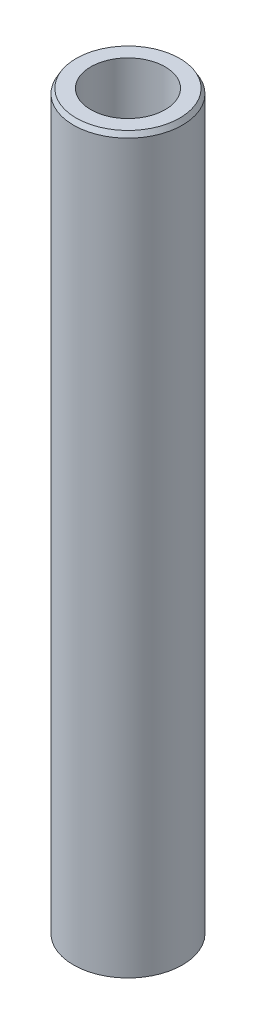
ISO-10303-21;
HEADER;
FILE_DESCRIPTION(('STEP AP214'),'2;1');
FILE_NAME('part.step','',(''),(''),'','','');
FILE_SCHEMA(('AUTOMOTIVE_DESIGN { 1 0 10303 214 1 1 1 1 }'));
ENDSEC;
DATA;
#1=APPLICATION_CONTEXT('core data for automotive mechanical design processes');
#2=APPLICATION_PROTOCOL_DEFINITION('international standard','automotive_design',2000,#1);
#3=PRODUCT_CONTEXT('',#1,'mechanical');
#4=PRODUCT('Part','Part','',(#3));
#5=PRODUCT_RELATED_PRODUCT_CATEGORY('part','',(#4));
#6=PRODUCT_DEFINITION_FORMATION('','',#4);
#7=PRODUCT_DEFINITION_CONTEXT('part definition',#1,'design');
#8=PRODUCT_DEFINITION('design','',#6,#7);
#9=PRODUCT_DEFINITION_SHAPE('','',#8);
#10=(LENGTH_UNIT() NAMED_UNIT(*) SI_UNIT(.MILLI.,.METRE.));
#11=(NAMED_UNIT(*) PLANE_ANGLE_UNIT() SI_UNIT($,.RADIAN.));
#12=(NAMED_UNIT(*) SI_UNIT($,.STERADIAN.) SOLID_ANGLE_UNIT());
#13=UNCERTAINTY_MEASURE_WITH_UNIT(LENGTH_MEASURE(1.E-05),#10,'distance_accuracy_value','');
#14=(GEOMETRIC_REPRESENTATION_CONTEXT(3) GLOBAL_UNCERTAINTY_ASSIGNED_CONTEXT((#13)) GLOBAL_UNIT_ASSIGNED_CONTEXT((#10,
#11,#12)) REPRESENTATION_CONTEXT('',''));
#15=CARTESIAN_POINT('',(0.,0.,0.));
#16=DIRECTION('',(0.,0.,1.));
#17=DIRECTION('',(1.,0.,0.));
#18=AXIS2_PLACEMENT_3D('',#15,#16,#17);
#19=CARTESIAN_POINT('',(0.,269.787280973071,0.));
#20=DIRECTION('',(0.,-1.,0.));
#21=DIRECTION('',(0.,0.,-1.));
#22=AXIS2_PLACEMENT_3D('',#19,#20,#21);
#23=CYLINDRICAL_SURFACE('',#22,20.);
#24=CARTESIAN_POINT('',(0.,268.043963825795,0.));
#25=DIRECTION('',(0.,1.,0.));
#26=DIRECTION('',(0.,0.,1.));
#27=AXIS2_PLACEMENT_3D('',#24,#25,#26);
#28=CIRCLE('',#27,20.);
#29=CARTESIAN_POINT('',(0.,268.043963825795,20.));
#30=VERTEX_POINT('',#29);
#31=EDGE_CURVE('E50',#30,#30,#28,.F.);
#32=ORIENTED_EDGE('',*,*,#31,.T.);
#33=EDGE_LOOP('',(#32));
#34=FACE_BOUND('',#33,.T.);
#35=CARTESIAN_POINT('',(0.,1.00650462426266,0.));
#36=DIRECTION('',(0.,1.,0.));
#37=DIRECTION('',(0.,0.,1.));
#38=AXIS2_PLACEMENT_3D('',#35,#36,#37);
#39=CIRCLE('',#38,20.);
#40=CARTESIAN_POINT('',(0.,1.00650462426266,20.));
#41=VERTEX_POINT('',#40);
#42=EDGE_CURVE('E51',#41,#41,#39,.T.);
#43=ORIENTED_EDGE('',*,*,#42,.T.);
#44=EDGE_LOOP('',(#43));
#45=FACE_BOUND('',#44,.T.);
#46=ADVANCED_FACE('F39',(#34,#45),#23,.T.);
#47=CARTESIAN_POINT('',(0.,269.787280973071,0.));
#48=DIRECTION('',(0.,1.,0.));
#49=DIRECTION('',(0.,0.,1.));
#50=AXIS2_PLACEMENT_3D('',#47,#48,#49);
#51=PLANE('',#50);
#52=CARTESIAN_POINT('',(0.,269.787280973071,0.));
#53=DIRECTION('',(0.,1.,0.));
#54=DIRECTION('',(0.,0.,1.));
#55=AXIS2_PLACEMENT_3D('',#52,#53,#54);
#56=CIRCLE('',#55,18.9934953757373);
#57=CARTESIAN_POINT('',(0.,269.787280973071,18.9934953757373));
#58=VERTEX_POINT('',#57);
#59=EDGE_CURVE('E54',#58,#58,#56,.T.);
#60=ORIENTED_EDGE('',*,*,#59,.T.);
#61=EDGE_LOOP('',(#60));
#62=FACE_BOUND('',#61,.T.);
#63=CARTESIAN_POINT('',(0.,269.787280973071,0.));
#64=DIRECTION('',(0.,1.,0.));
#65=DIRECTION('',(0.,0.,1.));
#66=AXIS2_PLACEMENT_3D('',#63,#64,#65);
#67=CIRCLE('',#66,13.6536611295665);
#68=CARTESIAN_POINT('',(0.,269.787280973071,13.6536611295665));
#69=VERTEX_POINT('',#68);
#70=EDGE_CURVE('E58',#69,#69,#67,.T.);
#71=ORIENTED_EDGE('',*,*,#70,.F.);
#72=EDGE_LOOP('',(#71));
#73=FACE_BOUND('',#72,.T.);
#74=ADVANCED_FACE('F69',(#62,#73),#51,.T.);
#75=CARTESIAN_POINT('',(0.,0.,0.));
#76=DIRECTION('',(0.,1.,0.));
#77=DIRECTION('',(0.,0.,1.));
#78=AXIS2_PLACEMENT_3D('',#75,#76,#77);
#79=PLANE('',#78);
#80=CARTESIAN_POINT('',(0.,0.,0.));
#81=DIRECTION('',(0.,1.,0.));
#82=DIRECTION('',(0.,0.,1.));
#83=AXIS2_PLACEMENT_3D('',#80,#81,#82);
#84=CIRCLE('',#83,18.256682852724);
#85=CARTESIAN_POINT('',(0.,0.,18.256682852724));
#86=VERTEX_POINT('',#85);
#87=EDGE_CURVE('E10',#86,#86,#84,.F.);
#88=ORIENTED_EDGE('',*,*,#87,.T.);
#89=EDGE_LOOP('',(#88));
#90=FACE_BOUND('',#89,.T.);
#91=CARTESIAN_POINT('',(0.,0.,0.));
#92=DIRECTION('',(0.,1.,0.));
#93=DIRECTION('',(0.,0.,1.));
#94=AXIS2_PLACEMENT_3D('',#91,#92,#93);
#95=CIRCLE('',#94,13.6536611295665);
#96=CARTESIAN_POINT('',(0.,0.,13.6536611295665));
#97=VERTEX_POINT('',#96);
#98=EDGE_CURVE('E63',#97,#97,#95,.T.);
#99=ORIENTED_EDGE('',*,*,#98,.T.);
#100=EDGE_LOOP('',(#99));
#101=FACE_BOUND('',#100,.T.);
#102=ADVANCED_FACE('F75',(#90,#101),#79,.F.);
#103=CARTESIAN_POINT('',(0.,269.787280973071,0.));
#104=DIRECTION('',(0.,-1.,0.));
#105=DIRECTION('',(0.,0.,-1.));
#106=AXIS2_PLACEMENT_3D('',#103,#104,#105);
#107=CYLINDRICAL_SURFACE('',#106,13.6536611295665);
#108=ORIENTED_EDGE('',*,*,#70,.T.);
#109=EDGE_LOOP('',(#108));
#110=FACE_BOUND('',#109,.T.);
#111=ORIENTED_EDGE('',*,*,#98,.F.);
#112=EDGE_LOOP('',(#111));
#113=FACE_BOUND('',#112,.T.);
#114=ADVANCED_FACE('F70',(#110,#113),#107,.F.);
#115=CARTESIAN_POINT('',(0.,269.787280973071,0.));
#116=DIRECTION('',(0.,-1.,0.));
#117=DIRECTION('',(0.,0.,-1.));
#118=AXIS2_PLACEMENT_3D('',#115,#116,#117);
#119=CONICAL_SURFACE('',#118,18.9934953757373,0.523598775598293);
#120=ORIENTED_EDGE('',*,*,#31,.F.);
#121=EDGE_LOOP('',(#120));
#122=FACE_BOUND('',#121,.T.);
#123=ORIENTED_EDGE('',*,*,#59,.F.);
#124=EDGE_LOOP('',(#123));
#125=FACE_BOUND('',#124,.T.);
#126=ADVANCED_FACE('F81',(#122,#125),#119,.T.);
#127=CARTESIAN_POINT('',(0.,1.00650462426266,0.));
#128=DIRECTION('',(0.,1.,0.));
#129=DIRECTION('',(0.,0.,1.));
#130=AXIS2_PLACEMENT_3D('',#127,#128,#129);
#131=CONICAL_SURFACE('',#130,20.,1.04719755119661);
#132=ORIENTED_EDGE('',*,*,#87,.F.);
#133=EDGE_LOOP('',(#132));
#134=FACE_BOUND('',#133,.T.);
#135=ORIENTED_EDGE('',*,*,#42,.F.);
#136=EDGE_LOOP('',(#135));
#137=FACE_BOUND('',#136,.T.);
#138=ADVANCED_FACE('F45',(#134,#137),#131,.T.);
#139=CLOSED_SHELL('',(#46,#74,#102,#114,#126,#138));
#140=MANIFOLD_SOLID_BREP('B2',#139);
#141=ADVANCED_BREP_SHAPE_REPRESENTATION('',(#18,#140),#14);
#142=SHAPE_DEFINITION_REPRESENTATION(#9,#141);
ENDSEC;
END-ISO-10303-21;
